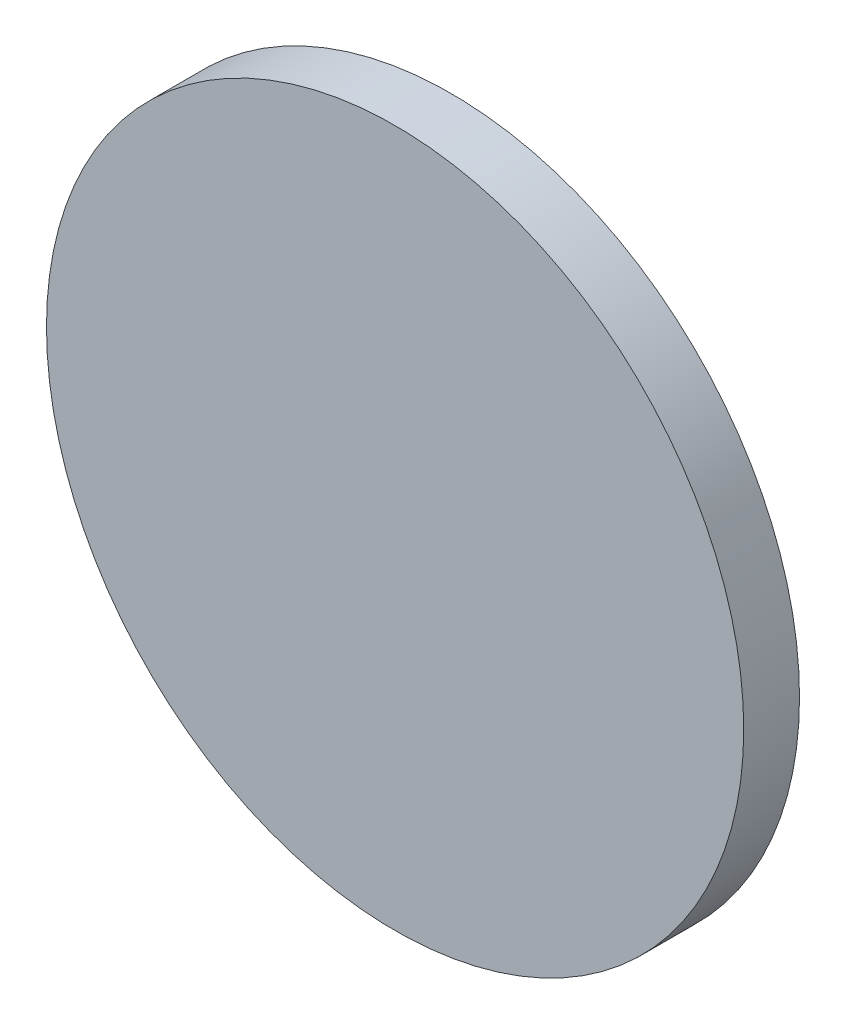
ISO-10303-21;
HEADER;
FILE_DESCRIPTION(('STEP AP214'),'2;1');
FILE_NAME('part.step','',(''),(''),'','','');
FILE_SCHEMA(('AUTOMOTIVE_DESIGN { 1 0 10303 214 1 1 1 1 }'));
ENDSEC;
DATA;
#1=APPLICATION_CONTEXT('core data for automotive mechanical design processes');
#2=APPLICATION_PROTOCOL_DEFINITION('international standard','automotive_design',2000,#1);
#3=PRODUCT_CONTEXT('',#1,'mechanical');
#4=PRODUCT('Part','Part','',(#3));
#5=PRODUCT_RELATED_PRODUCT_CATEGORY('part','',(#4));
#6=PRODUCT_DEFINITION_FORMATION('','',#4);
#7=PRODUCT_DEFINITION_CONTEXT('part definition',#1,'design');
#8=PRODUCT_DEFINITION('design','',#6,#7);
#9=PRODUCT_DEFINITION_SHAPE('','',#8);
#10=(LENGTH_UNIT() NAMED_UNIT(*) SI_UNIT(.MILLI.,.METRE.));
#11=(NAMED_UNIT(*) PLANE_ANGLE_UNIT() SI_UNIT($,.RADIAN.));
#12=(NAMED_UNIT(*) SI_UNIT($,.STERADIAN.) SOLID_ANGLE_UNIT());
#13=UNCERTAINTY_MEASURE_WITH_UNIT(LENGTH_MEASURE(1.E-05),#10,'distance_accuracy_value','');
#14=(GEOMETRIC_REPRESENTATION_CONTEXT(3) GLOBAL_UNCERTAINTY_ASSIGNED_CONTEXT((#13)) GLOBAL_UNIT_ASSIGNED_CONTEXT((#10,
#11,#12)) REPRESENTATION_CONTEXT('',''));
#15=CARTESIAN_POINT('',(0.,0.,0.));
#16=DIRECTION('',(0.,0.,1.));
#17=DIRECTION('',(1.,0.,0.));
#18=AXIS2_PLACEMENT_3D('',#15,#16,#17);
#19=CARTESIAN_POINT('',(0.,0.,2.));
#20=DIRECTION('',(0.,0.,-1.));
#21=DIRECTION('',(-1.,0.,0.));
#22=AXIS2_PLACEMENT_3D('',#19,#20,#21);
#23=CYLINDRICAL_SURFACE('',#22,12.5);
#24=CARTESIAN_POINT('',(0.,0.,2.));
#25=DIRECTION('',(0.,0.,1.));
#26=DIRECTION('',(1.,0.,0.));
#27=AXIS2_PLACEMENT_3D('',#24,#25,#26);
#28=CIRCLE('',#27,12.5);
#29=CARTESIAN_POINT('',(12.5,0.,2.));
#30=VERTEX_POINT('',#29);
#31=EDGE_CURVE('E10',#30,#30,#28,.T.);
#32=ORIENTED_EDGE('',*,*,#31,.F.);
#33=EDGE_LOOP('',(#32));
#34=FACE_BOUND('',#33,.T.);
#35=CARTESIAN_POINT('',(0.,0.,0.));
#36=DIRECTION('',(0.,0.,1.));
#37=DIRECTION('',(1.,0.,0.));
#38=AXIS2_PLACEMENT_3D('',#35,#36,#37);
#39=CIRCLE('',#38,12.5);
#40=CARTESIAN_POINT('',(12.5,0.,0.));
#41=VERTEX_POINT('',#40);
#42=EDGE_CURVE('E38',#41,#41,#39,.T.);
#43=ORIENTED_EDGE('',*,*,#42,.T.);
#44=EDGE_LOOP('',(#43));
#45=FACE_BOUND('',#44,.T.);
#46=ADVANCED_FACE('F35',(#34,#45),#23,.T.);
#47=CARTESIAN_POINT('',(0.,0.,2.));
#48=DIRECTION('',(0.,0.,1.));
#49=DIRECTION('',(1.,0.,0.));
#50=AXIS2_PLACEMENT_3D('',#47,#48,#49);
#51=PLANE('',#50);
#52=ORIENTED_EDGE('',*,*,#31,.T.);
#53=EDGE_LOOP('',(#52));
#54=FACE_BOUND('',#53,.T.);
#55=ADVANCED_FACE('F50',(#54),#51,.T.);
#56=CARTESIAN_POINT('',(0.,0.,0.));
#57=DIRECTION('',(0.,0.,1.));
#58=DIRECTION('',(1.,0.,0.));
#59=AXIS2_PLACEMENT_3D('',#56,#57,#58);
#60=PLANE('',#59);
#61=ORIENTED_EDGE('',*,*,#42,.F.);
#62=EDGE_LOOP('',(#61));
#63=FACE_BOUND('',#62,.T.);
#64=ADVANCED_FACE('F48',(#63),#60,.F.);
#65=CLOSED_SHELL('',(#46,#55,#64));
#66=MANIFOLD_SOLID_BREP('B2',#65);
#67=ADVANCED_BREP_SHAPE_REPRESENTATION('',(#18,#66),#14);
#68=SHAPE_DEFINITION_REPRESENTATION(#9,#67);
ENDSEC;
END-ISO-10303-21;
